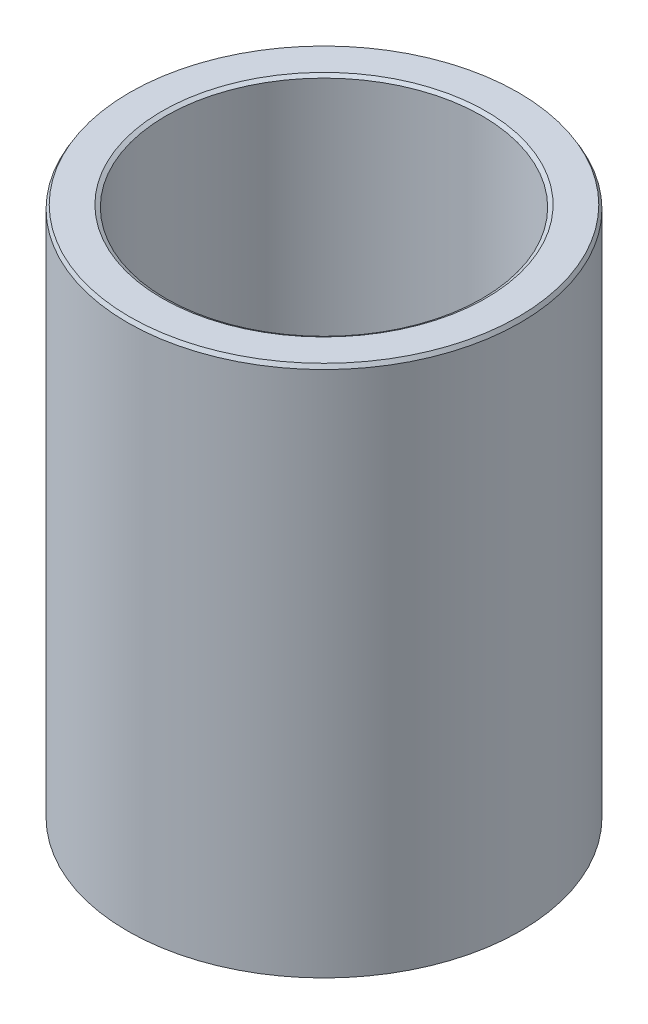
ISO-10303-21;
HEADER;
FILE_DESCRIPTION(('STEP AP214'),'2;1');
FILE_NAME('part.step','',(''),(''),'','','');
FILE_SCHEMA(('AUTOMOTIVE_DESIGN { 1 0 10303 214 1 1 1 1 }'));
ENDSEC;
DATA;
#1=APPLICATION_CONTEXT('core data for automotive mechanical design processes');
#2=APPLICATION_PROTOCOL_DEFINITION('international standard','automotive_design',2000,#1);
#3=PRODUCT_CONTEXT('',#1,'mechanical');
#4=PRODUCT('Part','Part','',(#3));
#5=PRODUCT_RELATED_PRODUCT_CATEGORY('part','',(#4));
#6=PRODUCT_DEFINITION_FORMATION('','',#4);
#7=PRODUCT_DEFINITION_CONTEXT('part definition',#1,'design');
#8=PRODUCT_DEFINITION('design','',#6,#7);
#9=PRODUCT_DEFINITION_SHAPE('','',#8);
#10=(LENGTH_UNIT() NAMED_UNIT(*) SI_UNIT(.MILLI.,.METRE.));
#11=(NAMED_UNIT(*) PLANE_ANGLE_UNIT() SI_UNIT($,.RADIAN.));
#12=(NAMED_UNIT(*) SI_UNIT($,.STERADIAN.) SOLID_ANGLE_UNIT());
#13=UNCERTAINTY_MEASURE_WITH_UNIT(LENGTH_MEASURE(1.E-05),#10,'distance_accuracy_value','');
#14=(GEOMETRIC_REPRESENTATION_CONTEXT(3) GLOBAL_UNCERTAINTY_ASSIGNED_CONTEXT((#13)) GLOBAL_UNIT_ASSIGNED_CONTEXT((#10,
#11,#12)) REPRESENTATION_CONTEXT('',''));
#15=CARTESIAN_POINT('',(0.,0.,0.));
#16=DIRECTION('',(0.,0.,1.));
#17=DIRECTION('',(1.,0.,0.));
#18=AXIS2_PLACEMENT_3D('',#15,#16,#17);
#19=CARTESIAN_POINT('',(0.,40.6776454031453,0.));
#20=DIRECTION('',(0.,-1.,0.));
#21=DIRECTION('',(0.,0.,-1.));
#22=AXIS2_PLACEMENT_3D('',#19,#20,#21);
#23=CYLINDRICAL_SURFACE('',#22,15.);
#24=CARTESIAN_POINT('',(0.,0.169917619201009,0.));
#25=DIRECTION('',(0.,1.,0.));
#26=DIRECTION('',(0.,0.,1.));
#27=AXIS2_PLACEMENT_3D('',#24,#25,#26);
#28=CIRCLE('',#27,15.);
#29=CARTESIAN_POINT('',(0.,0.169917619201009,-15.));
#30=VERTEX_POINT('',#29);
#31=EDGE_CURVE('E10',#30,#30,#28,.T.);
#32=CARTESIAN_POINT('',(0.,40.3833394535881,0.));
#33=DIRECTION('',(0.,1.,0.));
#34=DIRECTION('',(0.,0.,1.));
#35=AXIS2_PLACEMENT_3D('',#32,#33,#34);
#36=CIRCLE('',#35,15.);
#37=CARTESIAN_POINT('',(0.,40.3833394535881,-15.));
#38=VERTEX_POINT('',#37);
#39=EDGE_CURVE('E50',#38,#38,#36,.F.);
#40=CARTESIAN_POINT('',(0.,0.169917619201009,-15.));
#41=CARTESIAN_POINT('',(0.,0.588807429975873,-15.));
#42=CARTESIAN_POINT('',(0.,1.00769724075074,-15.));
#43=CARTESIAN_POINT('',(0.,1.84547686230047,-15.));
#44=CARTESIAN_POINT('',(0.,2.26436667307534,-15.));
#45=CARTESIAN_POINT('',(0.,3.10214629462507,-15.));
#46=CARTESIAN_POINT('',(0.,3.52103610539993,-15.));
#47=CARTESIAN_POINT('',(0.,4.35881572694966,-15.));
#48=CARTESIAN_POINT('',(0.,4.77770553772453,-15.));
#49=CARTESIAN_POINT('',(0.,5.61548515927426,-15.));
#50=CARTESIAN_POINT('',(0.,6.03437497004913,-15.));
#51=CARTESIAN_POINT('',(0.,6.87215459159886,-15.));
#52=CARTESIAN_POINT('',(0.,7.29104440237373,-15.));
#53=CARTESIAN_POINT('',(0.,8.12882402392346,-15.));
#54=CARTESIAN_POINT('',(0.,8.54771383469832,-15.));
#55=CARTESIAN_POINT('',(0.,9.38549345624805,-15.));
#56=CARTESIAN_POINT('',(0.,9.80438326702292,-15.));
#57=CARTESIAN_POINT('',(0.,10.6421628885726,-15.));
#58=CARTESIAN_POINT('',(0.,11.0610526993475,-15.));
#59=CARTESIAN_POINT('',(0.,11.8988323208972,-15.));
#60=CARTESIAN_POINT('',(0.,12.3177221316721,-15.));
#61=CARTESIAN_POINT('',(0.,13.1555017532218,-15.));
#62=CARTESIAN_POINT('',(0.,13.5743915639967,-15.));
#63=CARTESIAN_POINT('',(0.,14.4121711855464,-15.));
#64=CARTESIAN_POINT('',(0.,14.8310609963213,-15.));
#65=CARTESIAN_POINT('',(0.,15.668840617871,-15.));
#66=CARTESIAN_POINT('',(0.,16.0877304286459,-15.));
#67=CARTESIAN_POINT('',(0.,16.9255100501956,-15.));
#68=CARTESIAN_POINT('',(0.,17.3443998609705,-15.));
#69=CARTESIAN_POINT('',(0.,18.1821794825202,-15.));
#70=CARTESIAN_POINT('',(0.,18.6010692932951,-15.));
#71=CARTESIAN_POINT('',(0.,19.4388489148448,-15.));
#72=CARTESIAN_POINT('',(0.,19.8577387256197,-15.));
#73=CARTESIAN_POINT('',(0.,20.6955183471694,-15.));
#74=CARTESIAN_POINT('',(0.,21.1144081579443,-15.));
#75=CARTESIAN_POINT('',(0.,21.952187779494,-15.));
#76=CARTESIAN_POINT('',(0.,22.3710775902689,-15.));
#77=CARTESIAN_POINT('',(0.,23.2088572118186,-15.));
#78=CARTESIAN_POINT('',(0.,23.6277470225935,-15.));
#79=CARTESIAN_POINT('',(0.,24.4655266441432,-15.));
#80=CARTESIAN_POINT('',(0.,24.8844164549181,-15.));
#81=CARTESIAN_POINT('',(0.,25.7221960764678,-15.));
#82=CARTESIAN_POINT('',(0.,26.1410858872427,-15.));
#83=CARTESIAN_POINT('',(0.,26.9788655087924,-15.));
#84=CARTESIAN_POINT('',(0.,27.3977553195673,-15.));
#85=CARTESIAN_POINT('',(0.,28.235534941117,-15.));
#86=CARTESIAN_POINT('',(0.,28.6544247518919,-15.));
#87=CARTESIAN_POINT('',(0.,29.4922043734416,-15.));
#88=CARTESIAN_POINT('',(0.,29.9110941842165,-15.));
#89=CARTESIAN_POINT('',(0.,30.7488738057662,-15.));
#90=CARTESIAN_POINT('',(0.,31.1677636165411,-15.));
#91=CARTESIAN_POINT('',(0.,32.0055432380908,-15.));
#92=CARTESIAN_POINT('',(0.,32.4244330488657,-15.));
#93=CARTESIAN_POINT('',(0.,33.2622126704154,-15.));
#94=CARTESIAN_POINT('',(0.,33.6811024811903,-15.));
#95=CARTESIAN_POINT('',(0.,34.51888210274,-15.));
#96=CARTESIAN_POINT('',(0.,34.9377719135149,-15.));
#97=CARTESIAN_POINT('',(0.,35.7755515350646,-15.));
#98=CARTESIAN_POINT('',(0.,36.1944413458395,-15.));
#99=CARTESIAN_POINT('',(0.,37.0322209673892,-15.));
#100=CARTESIAN_POINT('',(0.,37.4511107781641,-15.));
#101=CARTESIAN_POINT('',(0.,38.2888903997138,-15.));
#102=CARTESIAN_POINT('',(0.,38.7077802104886,-15.));
#103=CARTESIAN_POINT('',(0.,39.5455598320384,-15.));
#104=CARTESIAN_POINT('',(0.,39.9644496428132,-15.));
#105=CARTESIAN_POINT('',(0.,40.3833394535881,-15.));
#106=B_SPLINE_CURVE_WITH_KNOTS('',3,(#40,#41,#42,#43,#44,#45,#46,#47,#48,#49,#50,#51,#52,#53,
#54,#55,#56,#57,#58,#59,#60,#61,#62,#63,#64,#65,#66,#67,#68,#69,#70,#71,#72,#73,#74,#75,#76,#77,
#78,#79,#80,#81,#82,#83,#84,#85,#86,#87,#88,#89,#90,#91,#92,#93,#94,#95,#96,#97,#98,#99,#100,
#101,#102,#103,#104,#105),.UNSPECIFIED.,.F.,.F.,(4,2,2,2,2,2,2,2,2,2,2,2,2,2,2,2,2,2,2,2,2,2,2,
2,2,2,2,2,2,2,2,2,4),(0.,1.25666943232459,2.5133388646492,3.77000829697379,5.02667772929839,
6.28334716162299,7.54001659394758,8.79668602627218,10.0533554585968,11.3100248909214,
12.566694323246,13.8233637555706,15.0800331878952,16.3367026202198,17.5933720525444,
18.850041484869,20.1067109171935,21.3633803495181,22.6200497818427,23.8767192141673,
25.1333886464919,26.3900580788165,27.6467275111411,28.9033969434657,30.1600663757903,
31.4167358081149,32.6734052404395,33.9300746727641,35.1867441050887,36.4434135374133,
37.7000829697379,38.9567524020625,40.2134218343871),.UNSPECIFIED.);
#107=EDGE_CURVE('BSEAM39',#30,#38,#106,.T.);
#108=ORIENTED_EDGE('',*,*,#31,.T.);
#109=ORIENTED_EDGE('',*,*,#39,.T.);
#110=ORIENTED_EDGE('',*,*,#107,.T.);
#111=ORIENTED_EDGE('',*,*,#107,.F.);
#112=EDGE_LOOP('',(#108,#110,#109,#111));
#113=FACE_BOUND('',#112,.T.);
#114=ADVANCED_FACE('F39',(#113),#23,.T.);
#115=CARTESIAN_POINT('',(0.,40.6776454031453,0.));
#116=DIRECTION('',(0.,1.,0.));
#117=DIRECTION('',(0.,0.,1.));
#118=AXIS2_PLACEMENT_3D('',#115,#116,#117);
#119=PLANE('',#118);
#120=CARTESIAN_POINT('',(0.,40.6776454031453,0.));
#121=DIRECTION('',(0.,1.,0.));
#122=DIRECTION('',(0.,0.,1.));
#123=AXIS2_PLACEMENT_3D('',#120,#121,#122);
#124=CIRCLE('',#123,12.3652586996916);
#125=CARTESIAN_POINT('',(0.,40.6776454031453,12.3652586996916));
#126=VERTEX_POINT('',#125);
#127=EDGE_CURVE('E58',#126,#126,#124,.F.);
#128=ORIENTED_EDGE('',*,*,#127,.T.);
#129=EDGE_LOOP('',(#128));
#130=FACE_BOUND('',#129,.T.);
#131=CARTESIAN_POINT('',(0.,40.6776454031453,0.));
#132=DIRECTION('',(0.,1.,0.));
#133=DIRECTION('',(0.,0.,1.));
#134=AXIS2_PLACEMENT_3D('',#131,#132,#133);
#135=CIRCLE('',#134,14.830082380799);
#136=CARTESIAN_POINT('',(0.,40.6776454031453,14.830082380799));
#137=VERTEX_POINT('',#136);
#138=EDGE_CURVE('E61',#137,#137,#135,.T.);
#139=ORIENTED_EDGE('',*,*,#138,.T.);
#140=EDGE_LOOP('',(#139));
#141=FACE_BOUND('',#140,.T.);
#142=ADVANCED_FACE('F88',(#130,#141),#119,.T.);
#143=CARTESIAN_POINT('',(0.,0.,0.));
#144=DIRECTION('',(0.,1.,0.));
#145=DIRECTION('',(0.,0.,1.));
#146=AXIS2_PLACEMENT_3D('',#143,#144,#145);
#147=PLANE('',#146);
#148=CARTESIAN_POINT('',(0.,0.,0.));
#149=DIRECTION('',(0.,1.,0.));
#150=DIRECTION('',(0.,0.,1.));
#151=AXIS2_PLACEMENT_3D('',#148,#149,#150);
#152=CIRCLE('',#151,12.2408703693353);
#153=CARTESIAN_POINT('',(0.,0.,12.2408703693353));
#154=VERTEX_POINT('',#153);
#155=EDGE_CURVE('E51',#154,#154,#152,.T.);
#156=ORIENTED_EDGE('',*,*,#155,.T.);
#157=EDGE_LOOP('',(#156));
#158=FACE_BOUND('',#157,.T.);
#159=CARTESIAN_POINT('',(0.,0.,0.));
#160=DIRECTION('',(0.,1.,0.));
#161=DIRECTION('',(0.,0.,1.));
#162=AXIS2_PLACEMENT_3D('',#159,#160,#161);
#163=CIRCLE('',#162,14.7056940504427);
#164=CARTESIAN_POINT('',(0.,0.,14.7056940504427));
#165=VERTEX_POINT('',#164);
#166=EDGE_CURVE('E54',#165,#165,#163,.F.);
#167=ORIENTED_EDGE('',*,*,#166,.T.);
#168=EDGE_LOOP('',(#167));
#169=FACE_BOUND('',#168,.T.);
#170=ADVANCED_FACE('F83',(#158,#169),#147,.F.);
#171=CARTESIAN_POINT('',(0.,40.6776454031453,0.));
#172=DIRECTION('',(0.,-1.,0.));
#173=DIRECTION('',(0.,0.,-1.));
#174=AXIS2_PLACEMENT_3D('',#171,#172,#173);
#175=CYLINDRICAL_SURFACE('',#174,12.0709527501343);
#176=CARTESIAN_POINT('',(0.,40.5077277839443,0.));
#177=DIRECTION('',(0.,1.,0.));
#178=DIRECTION('',(0.,0.,1.));
#179=AXIS2_PLACEMENT_3D('',#176,#177,#178);
#180=CIRCLE('',#179,12.0709527501343);
#181=CARTESIAN_POINT('',(0.,40.5077277839443,-12.0709527501343));
#182=VERTEX_POINT('',#181);
#183=EDGE_CURVE('E67',#182,#182,#180,.T.);
#184=CARTESIAN_POINT('',(0.,0.294305949557254,0.));
#185=DIRECTION('',(0.,1.,0.));
#186=DIRECTION('',(0.,0.,1.));
#187=AXIS2_PLACEMENT_3D('',#184,#185,#186);
#188=CIRCLE('',#187,12.0709527501343);
#189=CARTESIAN_POINT('',(0.,0.294305949557254,-12.0709527501343));
#190=VERTEX_POINT('',#189);
#191=EDGE_CURVE('E69',#190,#190,#188,.F.);
#192=CARTESIAN_POINT('',(0.,40.5077277839443,-12.0709527501343));
#193=CARTESIAN_POINT('',(0.,40.0888379731695,-12.0709527501343));
#194=CARTESIAN_POINT('',(0.,39.6699481623946,-12.0709527501343));
#195=CARTESIAN_POINT('',(0.,38.8321685408449,-12.0709527501343));
#196=CARTESIAN_POINT('',(0.,38.41327873007,-12.0709527501343));
#197=CARTESIAN_POINT('',(0.,37.5754991085203,-12.0709527501343));
#198=CARTESIAN_POINT('',(0.,37.1566092977454,-12.0709527501343));
#199=CARTESIAN_POINT('',(0.,36.3188296761957,-12.0709527501343));
#200=CARTESIAN_POINT('',(0.,35.8999398654208,-12.0709527501343));
#201=CARTESIAN_POINT('',(0.,35.0621602438711,-12.0709527501343));
#202=CARTESIAN_POINT('',(0.,34.6432704330962,-12.0709527501343));
#203=CARTESIAN_POINT('',(0.,33.8054908115465,-12.0709527501343));
#204=CARTESIAN_POINT('',(0.,33.3866010007716,-12.0709527501343));
#205=CARTESIAN_POINT('',(0.,32.5488213792219,-12.0709527501343));
#206=CARTESIAN_POINT('',(0.,32.129931568447,-12.0709527501343));
#207=CARTESIAN_POINT('',(0.,31.2921519468973,-12.0709527501343));
#208=CARTESIAN_POINT('',(0.,30.8732621361224,-12.0709527501343));
#209=CARTESIAN_POINT('',(0.,30.0354825145727,-12.0709527501343));
#210=CARTESIAN_POINT('',(0.,29.6165927037978,-12.0709527501343));
#211=CARTESIAN_POINT('',(0.,28.7788130822481,-12.0709527501343));
#212=CARTESIAN_POINT('',(0.,28.3599232714732,-12.0709527501343));
#213=CARTESIAN_POINT('',(0.,27.5221436499235,-12.0709527501343));
#214=CARTESIAN_POINT('',(0.,27.1032538391486,-12.0709527501343));
#215=CARTESIAN_POINT('',(0.,26.2654742175989,-12.0709527501343));
#216=CARTESIAN_POINT('',(0.,25.846584406824,-12.0709527501343));
#217=CARTESIAN_POINT('',(0.,25.0088047852743,-12.0709527501343));
#218=CARTESIAN_POINT('',(0.,24.5899149744994,-12.0709527501343));
#219=CARTESIAN_POINT('',(0.,23.7521353529497,-12.0709527501343));
#220=CARTESIAN_POINT('',(0.,23.3332455421749,-12.0709527501343));
#221=CARTESIAN_POINT('',(0.,22.4954659206251,-12.0709527501343));
#222=CARTESIAN_POINT('',(0.,22.0765761098503,-12.0709527501343));
#223=CARTESIAN_POINT('',(0.,21.2387964883005,-12.0709527501343));
#224=CARTESIAN_POINT('',(0.,20.8199066775257,-12.0709527501343));
#225=CARTESIAN_POINT('',(0.,19.9821270559759,-12.0709527501343));
#226=CARTESIAN_POINT('',(0.,19.5632372452011,-12.0709527501343));
#227=CARTESIAN_POINT('',(0.,18.7254576236513,-12.0709527501343));
#228=CARTESIAN_POINT('',(0.,18.3065678128765,-12.0709527501343));
#229=CARTESIAN_POINT('',(0.,17.4687881913267,-12.0709527501343));
#230=CARTESIAN_POINT('',(0.,17.0498983805519,-12.0709527501343));
#231=CARTESIAN_POINT('',(0.,16.2121187590021,-12.0709527501343));
#232=CARTESIAN_POINT('',(0.,15.7932289482273,-12.0709527501343));
#233=CARTESIAN_POINT('',(0.,14.9554493266775,-12.0709527501343));
#234=CARTESIAN_POINT('',(0.,14.5365595159027,-12.0709527501343));
#235=CARTESIAN_POINT('',(0.,13.6987798943529,-12.0709527501343));
#236=CARTESIAN_POINT('',(0.,13.2798900835781,-12.0709527501343));
#237=CARTESIAN_POINT('',(0.,12.4421104620283,-12.0709527501343));
#238=CARTESIAN_POINT('',(0.,12.0232206512535,-12.0709527501343));
#239=CARTESIAN_POINT('',(0.,11.1854410297038,-12.0709527501343));
#240=CARTESIAN_POINT('',(0.,10.7665512189289,-12.0709527501343));
#241=CARTESIAN_POINT('',(0.,9.92877159737916,-12.0709527501343));
#242=CARTESIAN_POINT('',(0.,9.50988178660429,-12.0709527501343));
#243=CARTESIAN_POINT('',(0.,8.67210216505457,-12.0709527501343));
#244=CARTESIAN_POINT('',(0.,8.2532123542797,-12.0709527501343));
#245=CARTESIAN_POINT('',(0.,7.41543273272997,-12.0709527501343));
#246=CARTESIAN_POINT('',(0.,6.99654292195511,-12.0709527501343));
#247=CARTESIAN_POINT('',(0.,6.15876330040538,-12.0709527501343));
#248=CARTESIAN_POINT('',(0.,5.73987348963051,-12.0709527501343));
#249=CARTESIAN_POINT('',(0.,4.90209386808078,-12.0709527501343));
#250=CARTESIAN_POINT('',(0.,4.48320405730592,-12.0709527501343));
#251=CARTESIAN_POINT('',(0.,3.64542443575618,-12.0709527501343));
#252=CARTESIAN_POINT('',(0.,3.22653462498131,-12.0709527501343));
#253=CARTESIAN_POINT('',(0.,2.38875500343158,-12.0709527501343));
#254=CARTESIAN_POINT('',(0.,1.96986519265671,-12.0709527501343));
#255=CARTESIAN_POINT('',(0.,1.13208557110698,-12.0709527501343));
#256=CARTESIAN_POINT('',(0.,0.713195760332119,-12.0709527501343));
#257=CARTESIAN_POINT('',(0.,0.294305949557254,-12.0709527501343));
#258=B_SPLINE_CURVE_WITH_KNOTS('',3,(#192,#193,#194,#195,#196,#197,#198,#199,#200,#201,#202,
#203,#204,#205,#206,#207,#208,#209,#210,#211,#212,#213,#214,#215,#216,#217,#218,#219,#220,#221,
#222,#223,#224,#225,#226,#227,#228,#229,#230,#231,#232,#233,#234,#235,#236,#237,#238,#239,#240,
#241,#242,#243,#244,#245,#246,#247,#248,#249,#250,#251,#252,#253,#254,#255,#256,#257),
.UNSPECIFIED.,.F.,.F.,(4,2,2,2,2,2,2,2,2,2,2,2,2,2,2,2,2,2,2,2,2,2,2,2,2,2,2,2,2,2,2,2,4),(0.,
1.2566694323246,2.5133388646492,3.77000829697379,5.02667772929839,6.28334716162298,
7.54001659394758,8.79668602627217,10.0533554585968,11.3100248909214,12.566694323246,
13.8233637555706,15.0800331878952,16.3367026202198,17.5933720525443,18.8500414848689,
20.1067109171935,21.3633803495181,22.6200497818427,23.8767192141673,25.1333886464919,
26.3900580788165,27.6467275111411,28.9033969434657,30.1600663757903,31.4167358081149,
32.6734052404395,33.9300746727641,35.1867441050887,36.4434135374133,37.7000829697379,
38.9567524020625,40.2134218343871),.UNSPECIFIED.);
#259=EDGE_CURVE('BSEAM71',#182,#190,#258,.T.);
#260=ORIENTED_EDGE('',*,*,#183,.T.);
#261=ORIENTED_EDGE('',*,*,#191,.T.);
#262=ORIENTED_EDGE('',*,*,#259,.T.);
#263=ORIENTED_EDGE('',*,*,#259,.F.);
#264=EDGE_LOOP('',(#260,#262,#261,#263));
#265=FACE_BOUND('',#264,.T.);
#266=ADVANCED_FACE('F71',(#265),#175,.F.);
#267=CARTESIAN_POINT('',(0.,40.5077277839443,0.));
#268=DIRECTION('',(0.,1.,0.));
#269=DIRECTION('',(0.,0.,1.));
#270=AXIS2_PLACEMENT_3D('',#267,#268,#269);
#271=CONICAL_SURFACE('',#270,12.0709527501343,1.0471975511966);
#272=ORIENTED_EDGE('',*,*,#127,.F.);
#273=EDGE_LOOP('',(#272));
#274=FACE_BOUND('',#273,.T.);
#275=ORIENTED_EDGE('',*,*,#183,.F.);
#276=EDGE_LOOP('',(#275));
#277=FACE_BOUND('',#276,.T.);
#278=ADVANCED_FACE('F77',(#274,#277),#271,.F.);
#279=CARTESIAN_POINT('',(0.,0.,0.));
#280=DIRECTION('',(0.,-1.,0.));
#281=DIRECTION('',(0.,0.,-1.));
#282=AXIS2_PLACEMENT_3D('',#279,#280,#281);
#283=CONICAL_SURFACE('',#282,12.2408703693353,0.5235987755983);
#284=ORIENTED_EDGE('',*,*,#191,.F.);
#285=EDGE_LOOP('',(#284));
#286=FACE_BOUND('',#285,.T.);
#287=ORIENTED_EDGE('',*,*,#155,.F.);
#288=EDGE_LOOP('',(#287));
#289=FACE_BOUND('',#288,.T.);
#290=ADVANCED_FACE('F73',(#286,#289),#283,.F.);
#291=CARTESIAN_POINT('',(0.,0.169917619201009,0.));
#292=DIRECTION('',(0.,1.,0.));
#293=DIRECTION('',(0.,0.,1.));
#294=AXIS2_PLACEMENT_3D('',#291,#292,#293);
#295=CONICAL_SURFACE('',#294,15.,1.0471975511966);
#296=ORIENTED_EDGE('',*,*,#166,.F.);
#297=EDGE_LOOP('',(#296));
#298=FACE_BOUND('',#297,.T.);
#299=ORIENTED_EDGE('',*,*,#31,.F.);
#300=EDGE_LOOP('',(#299));
#301=FACE_BOUND('',#300,.T.);
#302=ADVANCED_FACE('F76',(#298,#301),#295,.T.);
#303=CARTESIAN_POINT('',(0.,40.6776454031453,0.));
#304=DIRECTION('',(0.,-1.,0.));
#305=DIRECTION('',(0.,0.,-1.));
#306=AXIS2_PLACEMENT_3D('',#303,#304,#305);
#307=CONICAL_SURFACE('',#306,14.830082380799,0.52359877559828);
#308=ORIENTED_EDGE('',*,*,#39,.F.);
#309=EDGE_LOOP('',(#308));
#310=FACE_BOUND('',#309,.T.);
#311=ORIENTED_EDGE('',*,*,#138,.F.);
#312=EDGE_LOOP('',(#311));
#313=FACE_BOUND('',#312,.T.);
#314=ADVANCED_FACE('F45',(#310,#313),#307,.T.);
#315=CLOSED_SHELL('',(#114,#142,#170,#266,#278,#290,#302,#314));
#316=MANIFOLD_SOLID_BREP('B2',#315);
#317=ADVANCED_BREP_SHAPE_REPRESENTATION('',(#18,#316),#14);
#318=SHAPE_DEFINITION_REPRESENTATION(#9,#317);
ENDSEC;
END-ISO-10303-21;
